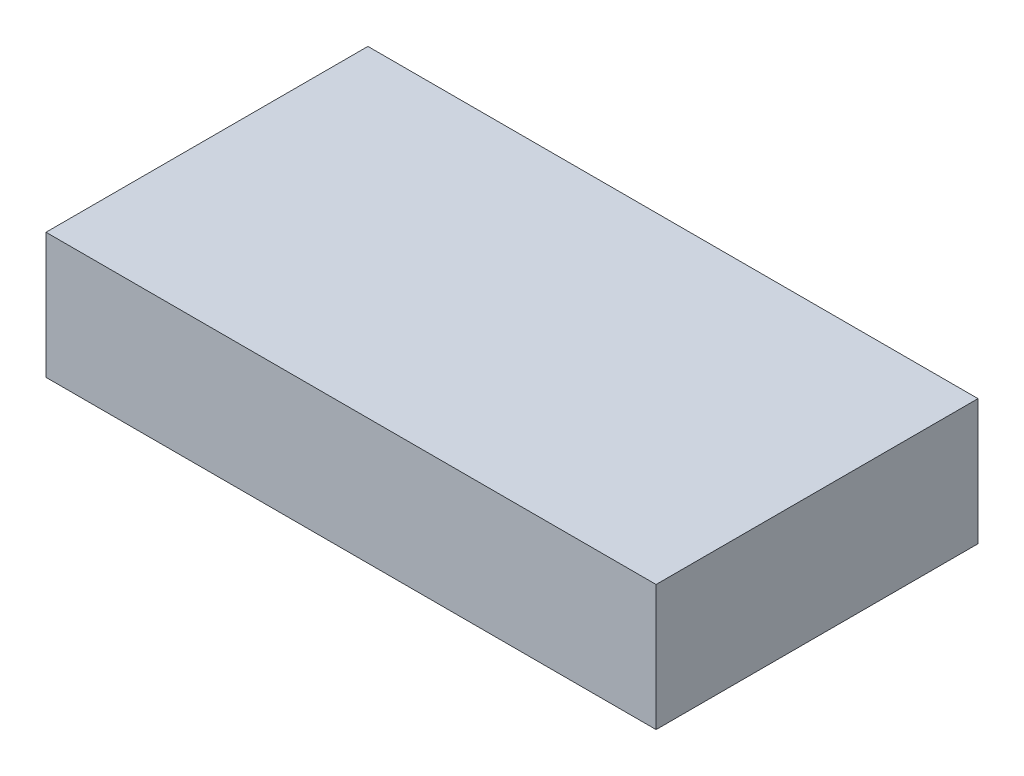
ISO-10303-21;
HEADER;
FILE_DESCRIPTION(('STEP AP214'),'2;1');
FILE_NAME('part.step','',(''),(''),'','','');
FILE_SCHEMA(('AUTOMOTIVE_DESIGN { 1 0 10303 214 1 1 1 1 }'));
ENDSEC;
DATA;
#1=APPLICATION_CONTEXT('core data for automotive mechanical design processes');
#2=APPLICATION_PROTOCOL_DEFINITION('international standard','automotive_design',2000,#1);
#3=PRODUCT_CONTEXT('',#1,'mechanical');
#4=PRODUCT('Part','Part','',(#3));
#5=PRODUCT_RELATED_PRODUCT_CATEGORY('part','',(#4));
#6=PRODUCT_DEFINITION_FORMATION('','',#4);
#7=PRODUCT_DEFINITION_CONTEXT('part definition',#1,'design');
#8=PRODUCT_DEFINITION('design','',#6,#7);
#9=PRODUCT_DEFINITION_SHAPE('','',#8);
#10=(LENGTH_UNIT() NAMED_UNIT(*) SI_UNIT(.MILLI.,.METRE.));
#11=(NAMED_UNIT(*) PLANE_ANGLE_UNIT() SI_UNIT($,.RADIAN.));
#12=(NAMED_UNIT(*) SI_UNIT($,.STERADIAN.) SOLID_ANGLE_UNIT());
#13=UNCERTAINTY_MEASURE_WITH_UNIT(LENGTH_MEASURE(1.E-05),#10,'distance_accuracy_value','');
#14=(GEOMETRIC_REPRESENTATION_CONTEXT(3) GLOBAL_UNCERTAINTY_ASSIGNED_CONTEXT((#13)) GLOBAL_UNIT_ASSIGNED_CONTEXT((#10,
#11,#12)) REPRESENTATION_CONTEXT('',''));
#15=CARTESIAN_POINT('',(0.,0.,0.));
#16=DIRECTION('',(0.,0.,1.));
#17=DIRECTION('',(1.,0.,0.));
#18=AXIS2_PLACEMENT_3D('',#15,#16,#17);
#19=CARTESIAN_POINT('',(99.5,41.,52.5));
#20=DIRECTION('',(-1.,0.,0.));
#21=DIRECTION('',(0.,0.,1.));
#22=AXIS2_PLACEMENT_3D('',#19,#20,#21);
#23=PLANE('',#22);
#24=DIRECTION('',(0.,0.,-1.));
#25=VECTOR('',#24,1.);
#26=CARTESIAN_POINT('',(99.5,0.,52.5));
#27=LINE('',#26,#25);
#28=CARTESIAN_POINT('',(99.5,0.,52.5));
#29=VERTEX_POINT('',#28);
#30=CARTESIAN_POINT('',(99.5,0.,-52.5));
#31=VERTEX_POINT('',#30);
#32=EDGE_CURVE('E111',#29,#31,#27,.T.);
#33=ORIENTED_EDGE('',*,*,#32,.T.);
#34=DIRECTION('',(0.,-1.,0.));
#35=VECTOR('',#34,1.);
#36=CARTESIAN_POINT('',(99.5,41.,-52.5));
#37=LINE('',#36,#35);
#38=CARTESIAN_POINT('',(99.5,41.,-52.5));
#39=VERTEX_POINT('',#38);
#40=EDGE_CURVE('E11',#39,#31,#37,.T.);
#41=ORIENTED_EDGE('',*,*,#40,.F.);
#42=DIRECTION('',(0.,0.,-1.));
#43=VECTOR('',#42,1.);
#44=CARTESIAN_POINT('',(99.5,41.,52.5));
#45=LINE('',#44,#43);
#46=CARTESIAN_POINT('',(99.5,41.,52.5));
#47=VERTEX_POINT('',#46);
#48=EDGE_CURVE('E95',#47,#39,#45,.T.);
#49=ORIENTED_EDGE('',*,*,#48,.F.);
#50=DIRECTION('',(0.,-1.,0.));
#51=VECTOR('',#50,1.);
#52=CARTESIAN_POINT('',(99.5,41.,52.5));
#53=LINE('',#52,#51);
#54=EDGE_CURVE('E107',#47,#29,#53,.T.);
#55=ORIENTED_EDGE('',*,*,#54,.T.);
#56=EDGE_LOOP('',(#33,#41,#49,#55));
#57=FACE_BOUND('',#56,.T.);
#58=ADVANCED_FACE('F43',(#57),#23,.F.);
#59=CARTESIAN_POINT('',(-99.5,41.,-52.5));
#60=DIRECTION('',(0.,0.,1.));
#61=DIRECTION('',(1.,0.,0.));
#62=AXIS2_PLACEMENT_3D('',#59,#60,#61);
#63=PLANE('',#62);
#64=DIRECTION('',(-1.,0.,0.));
#65=VECTOR('',#64,1.);
#66=CARTESIAN_POINT('',(-99.5,0.,-52.5));
#67=LINE('',#66,#65);
#68=CARTESIAN_POINT('',(-99.5,0.,-52.5));
#69=VERTEX_POINT('',#68);
#70=EDGE_CURVE('E100',#31,#69,#67,.T.);
#71=ORIENTED_EDGE('',*,*,#70,.T.);
#72=DIRECTION('',(0.,-1.,0.));
#73=VECTOR('',#72,1.);
#74=CARTESIAN_POINT('',(-99.5,41.,-52.5));
#75=LINE('',#74,#73);
#76=CARTESIAN_POINT('',(-99.5,41.,-52.5));
#77=VERTEX_POINT('',#76);
#78=EDGE_CURVE('E52',#77,#69,#75,.T.);
#79=ORIENTED_EDGE('',*,*,#78,.F.);
#80=DIRECTION('',(-1.,0.,0.));
#81=VECTOR('',#80,1.);
#82=CARTESIAN_POINT('',(-99.5,41.,-52.5));
#83=LINE('',#82,#81);
#84=EDGE_CURVE('E90',#39,#77,#83,.T.);
#85=ORIENTED_EDGE('',*,*,#84,.F.);
#86=ORIENTED_EDGE('',*,*,#40,.T.);
#87=EDGE_LOOP('',(#71,#79,#85,#86));
#88=FACE_BOUND('',#87,.T.);
#89=ADVANCED_FACE('F99',(#88),#63,.F.);
#90=CARTESIAN_POINT('',(-99.5,41.,52.5));
#91=DIRECTION('',(1.,0.,0.));
#92=DIRECTION('',(0.,0.,-1.));
#93=AXIS2_PLACEMENT_3D('',#90,#91,#92);
#94=PLANE('',#93);
#95=DIRECTION('',(0.,0.,1.));
#96=VECTOR('',#95,1.);
#97=CARTESIAN_POINT('',(-99.5,0.,52.5));
#98=LINE('',#97,#96);
#99=CARTESIAN_POINT('',(-99.5,0.,52.5));
#100=VERTEX_POINT('',#99);
#101=EDGE_CURVE('E77',#69,#100,#98,.T.);
#102=ORIENTED_EDGE('',*,*,#101,.T.);
#103=DIRECTION('',(0.,-1.,0.));
#104=VECTOR('',#103,1.);
#105=CARTESIAN_POINT('',(-99.5,41.,52.5));
#106=LINE('',#105,#104);
#107=CARTESIAN_POINT('',(-99.5,41.,52.5));
#108=VERTEX_POINT('',#107);
#109=EDGE_CURVE('E102',#108,#100,#106,.T.);
#110=ORIENTED_EDGE('',*,*,#109,.F.);
#111=DIRECTION('',(0.,0.,1.));
#112=VECTOR('',#111,1.);
#113=CARTESIAN_POINT('',(-99.5,41.,52.5));
#114=LINE('',#113,#112);
#115=EDGE_CURVE('E93',#77,#108,#114,.T.);
#116=ORIENTED_EDGE('',*,*,#115,.F.);
#117=ORIENTED_EDGE('',*,*,#78,.T.);
#118=EDGE_LOOP('',(#102,#110,#116,#117));
#119=FACE_BOUND('',#118,.T.);
#120=ADVANCED_FACE('F103',(#119),#94,.F.);
#121=CARTESIAN_POINT('',(-99.5,41.,52.5));
#122=DIRECTION('',(0.,0.,-1.));
#123=DIRECTION('',(-1.,0.,0.));
#124=AXIS2_PLACEMENT_3D('',#121,#122,#123);
#125=PLANE('',#124);
#126=DIRECTION('',(1.,0.,0.));
#127=VECTOR('',#126,1.);
#128=CARTESIAN_POINT('',(-99.5,0.,52.5));
#129=LINE('',#128,#127);
#130=EDGE_CURVE('E83',#100,#29,#129,.T.);
#131=ORIENTED_EDGE('',*,*,#130,.T.);
#132=ORIENTED_EDGE('',*,*,#54,.F.);
#133=DIRECTION('',(1.,0.,0.));
#134=VECTOR('',#133,1.);
#135=CARTESIAN_POINT('',(-99.5,41.,52.5));
#136=LINE('',#135,#134);
#137=EDGE_CURVE('E60',#108,#47,#136,.T.);
#138=ORIENTED_EDGE('',*,*,#137,.F.);
#139=ORIENTED_EDGE('',*,*,#109,.T.);
#140=EDGE_LOOP('',(#131,#132,#138,#139));
#141=FACE_BOUND('',#140,.T.);
#142=ADVANCED_FACE('F124',(#141),#125,.F.);
#143=CARTESIAN_POINT('',(0.,41.,0.));
#144=DIRECTION('',(0.,-1.,0.));
#145=DIRECTION('',(0.,0.,-1.));
#146=AXIS2_PLACEMENT_3D('',#143,#144,#145);
#147=PLANE('',#146);
#148=ORIENTED_EDGE('',*,*,#48,.T.);
#149=ORIENTED_EDGE('',*,*,#84,.T.);
#150=ORIENTED_EDGE('',*,*,#115,.T.);
#151=ORIENTED_EDGE('',*,*,#137,.T.);
#152=EDGE_LOOP('',(#148,#149,#150,#151));
#153=FACE_BOUND('',#152,.T.);
#154=ADVANCED_FACE('F91',(#153),#147,.F.);
#155=CARTESIAN_POINT('',(0.,0.,0.));
#156=DIRECTION('',(0.,-1.,0.));
#157=DIRECTION('',(0.,0.,-1.));
#158=AXIS2_PLACEMENT_3D('',#155,#156,#157);
#159=PLANE('',#158);
#160=ORIENTED_EDGE('',*,*,#32,.F.);
#161=ORIENTED_EDGE('',*,*,#130,.F.);
#162=ORIENTED_EDGE('',*,*,#101,.F.);
#163=ORIENTED_EDGE('',*,*,#70,.F.);
#164=EDGE_LOOP('',(#160,#161,#162,#163));
#165=FACE_BOUND('',#164,.T.);
#166=ADVANCED_FACE('F127',(#165),#159,.T.);
#167=CLOSED_SHELL('',(#58,#89,#120,#142,#154,#166));
#168=MANIFOLD_SOLID_BREP('B2',#167);
#169=ADVANCED_BREP_SHAPE_REPRESENTATION('',(#18,#168),#14);
#170=SHAPE_DEFINITION_REPRESENTATION(#9,#169);
ENDSEC;
END-ISO-10303-21;
